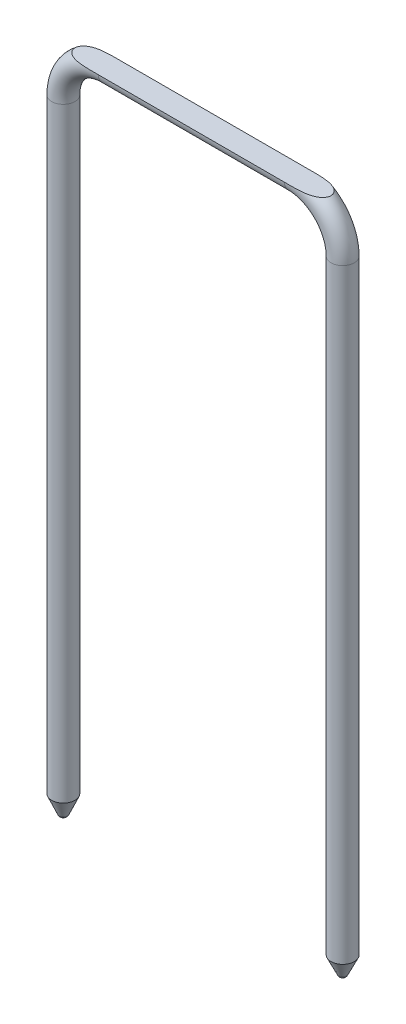
ISO-10303-21;
HEADER;
FILE_DESCRIPTION(('STEP AP214'),'2;1');
FILE_NAME('part.step','',(''),(''),'','','');
FILE_SCHEMA(('AUTOMOTIVE_DESIGN { 1 0 10303 214 1 1 1 1 }'));
ENDSEC;
DATA;
#1=APPLICATION_CONTEXT('core data for automotive mechanical design processes');
#2=APPLICATION_PROTOCOL_DEFINITION('international standard','automotive_design',2000,#1);
#3=PRODUCT_CONTEXT('',#1,'mechanical');
#4=PRODUCT('Part','Part','',(#3));
#5=PRODUCT_RELATED_PRODUCT_CATEGORY('part','',(#4));
#6=PRODUCT_DEFINITION_FORMATION('','',#4);
#7=PRODUCT_DEFINITION_CONTEXT('part definition',#1,'design');
#8=PRODUCT_DEFINITION('design','',#6,#7);
#9=PRODUCT_DEFINITION_SHAPE('','',#8);
#10=(LENGTH_UNIT() NAMED_UNIT(*) SI_UNIT(.MILLI.,.METRE.));
#11=(NAMED_UNIT(*) PLANE_ANGLE_UNIT() SI_UNIT($,.RADIAN.));
#12=(NAMED_UNIT(*) SI_UNIT($,.STERADIAN.) SOLID_ANGLE_UNIT());
#13=UNCERTAINTY_MEASURE_WITH_UNIT(LENGTH_MEASURE(1.E-05),#10,'distance_accuracy_value','');
#14=(GEOMETRIC_REPRESENTATION_CONTEXT(3) GLOBAL_UNCERTAINTY_ASSIGNED_CONTEXT((#13)) GLOBAL_UNIT_ASSIGNED_CONTEXT((#10,
#11,#12)) REPRESENTATION_CONTEXT('',''));
#15=CARTESIAN_POINT('',(0.,0.,0.));
#16=DIRECTION('',(0.,0.,1.));
#17=DIRECTION('',(1.,0.,0.));
#18=AXIS2_PLACEMENT_3D('',#15,#16,#17);
#19=CARTESIAN_POINT('',(50.,130.,0.));
#20=DIRECTION('',(0.,0.,-1.));
#21=DIRECTION('',(-1.,0.,0.));
#22=AXIS2_PLACEMENT_3D('',#19,#20,#21);
#23=TOROIDAL_SURFACE('',#22,9.99999999999998,2.5);
#24=CARTESIAN_POINT('',(60.,130.,0.));
#25=DIRECTION('',(0.,-1.,0.));
#26=DIRECTION('',(0.,0.,1.));
#27=AXIS2_PLACEMENT_3D('',#24,#25,#26);
#28=CIRCLE('',#27,2.5);
#29=CARTESIAN_POINT('',(60.,130.,2.5));
#30=VERTEX_POINT('',#29);
#31=EDGE_CURVE('E89',#30,#30,#28,.T.);
#32=ORIENTED_EDGE('',*,*,#31,.F.);
#33=EDGE_LOOP('',(#32));
#34=FACE_BOUND('',#33,.T.);
#35=CARTESIAN_POINT('',(50.,140.,0.));
#36=DIRECTION('',(1.,0.,0.));
#37=DIRECTION('',(0.,0.,1.));
#38=AXIS2_PLACEMENT_3D('',#35,#36,#37);
#39=CIRCLE('',#38,2.5);
#40=CARTESIAN_POINT('',(50.,140.,2.5));
#41=VERTEX_POINT('',#40);
#42=CARTESIAN_POINT('',(50.,140.,-2.5));
#43=VERTEX_POINT('',#42);
#44=EDGE_CURVE('E83',#41,#43,#39,.T.);
#45=ORIENTED_EDGE('',*,*,#44,.T.);
#46=CARTESIAN_POINT('',(57.5,140.,0.));
#47=CARTESIAN_POINT('',(57.4999853952668,140.,0.0991316136780097));
#48=CARTESIAN_POINT('',(57.4900660240153,140.,0.198419454960006));
#49=CARTESIAN_POINT('',(57.4512969231497,140.,0.393312871097621));
#50=CARTESIAN_POINT('',(57.4224020057191,140.,0.488909077991788));
#51=CARTESIAN_POINT('',(57.3485058720528,140.,0.672594140153357));
#52=CARTESIAN_POINT('',(57.3036462931456,140.,0.760740836193033));
#53=CARTESIAN_POINT('',(57.200815819489,140.,0.928904151505597));
#54=CARTESIAN_POINT('',(57.142840555888,140.,1.00891804883215));
#55=CARTESIAN_POINT('',(56.9880862702515,140.,1.19461571914126));
#56=CARTESIAN_POINT('',(56.8856173457104,140.,1.29553860751711));
#57=CARTESIAN_POINT('',(56.6661734051504,140.,1.48003248284283));
#58=CARTESIAN_POINT('',(56.5491701809111,140.,1.56356885851045));
#59=CARTESIAN_POINT('',(56.3280321612715,140.,1.70122471069441));
#60=CARTESIAN_POINT('',(56.2254712435093,140.,1.75792951552601));
#61=CARTESIAN_POINT('',(56.0157598175273,140.,1.86223008538179));
#62=CARTESIAN_POINT('',(55.9086058093265,140.,1.90981874719111));
#63=CARTESIAN_POINT('',(55.6909035214289,140.,1.99705742516265));
#64=CARTESIAN_POINT('',(55.5803488716588,140.,2.03669134586337));
#65=CARTESIAN_POINT('',(55.3570799376479,140.,2.10892030850186));
#66=CARTESIAN_POINT('',(55.2443672281763,140.,2.14152028494196));
#67=CARTESIAN_POINT('',(54.8993282017732,140.,2.23146090967274));
#68=CARTESIAN_POINT('',(54.6645174199831,140.,2.27927036435045));
#69=CARTESIAN_POINT('',(54.1918306493491,140.,2.35659967637171));
#70=CARTESIAN_POINT('',(53.9539510187098,140.,2.38609527156261));
#71=CARTESIAN_POINT('',(53.4758636094267,140.,2.43225802545843));
#72=CARTESIAN_POINT('',(53.2356501362112,140.,2.44886286524089));
#73=CARTESIAN_POINT('',(52.7549478751368,140.,2.47346059126281));
#74=CARTESIAN_POINT('',(52.514459266318,140.,2.48145746257494));
#75=CARTESIAN_POINT('',(52.0310941006776,140.,2.49245968519802));
#76=CARTESIAN_POINT('',(51.7882166342279,140.,2.49541672669688));
#77=CARTESIAN_POINT('',(51.3024328311938,140.,2.498944504777));
#78=CARTESIAN_POINT('',(51.0595264938498,140.,2.49951505149338));
#79=CARTESIAN_POINT('',(50.574354988398,140.,2.50004099745329));
#80=CARTESIAN_POINT('',(50.3320898200265,140.,2.49999801619718));
#81=CARTESIAN_POINT('',(49.8475662698254,140.,2.50000191865032));
#82=CARTESIAN_POINT('',(49.6053078879971,140.,2.50004879982595));
#83=CARTESIAN_POINT('',(49.2037676693959,140.,2.49983177952314));
#84=CARTESIAN_POINT('',(49.0444858275523,140.,2.49966882513934));
#85=CARTESIAN_POINT('',(48.7259232313356,140.,2.49879598776342));
#86=CARTESIAN_POINT('',(48.5666424769618,140.,2.49808610518457));
#87=CARTESIAN_POINT('',(48.2479126317765,140.,2.49555502653143));
#88=CARTESIAN_POINT('',(48.0884635490271,140.,2.49373260581561));
#89=CARTESIAN_POINT('',(47.7695917147429,140.,2.48822415252106));
#90=CARTESIAN_POINT('',(47.6101689636823,140.,2.48453808940716));
#91=CARTESIAN_POINT('',(47.2918320488864,140.,2.47439527781919));
#92=CARTESIAN_POINT('',(47.1329176639989,140.,2.46794595552734));
#93=CARTESIAN_POINT('',(46.8152943064085,140.,2.45119875549953));
#94=CARTESIAN_POINT('',(46.656585319234,140.,2.44090116558329));
#95=CARTESIAN_POINT('',(46.339767525041,140.,2.41522231939595));
#96=CARTESIAN_POINT('',(46.1816582116496,140.,2.39984753925364));
#97=CARTESIAN_POINT('',(45.8661569925469,140.,2.36257125345405));
#98=CARTESIAN_POINT('',(45.7087652374626,140.,2.3406684362112));
#99=CARTESIAN_POINT('',(45.3923999564315,140.,2.28819973133559));
#100=CARTESIAN_POINT('',(45.2334511750606,140.,2.25748081428366));
#101=CARTESIAN_POINT('',(44.9179852334303,140.,2.18554389487908));
#102=CARTESIAN_POINT('',(44.761466735726,140.,2.14433190132641));
#103=CARTESIAN_POINT('',(44.453106358361,140.,2.04928051297231));
#104=CARTESIAN_POINT('',(44.3012447837885,140.,1.99550623117653));
#105=CARTESIAN_POINT('',(44.0039747217832,140.,1.87259157812549));
#106=CARTESIAN_POINT('',(43.8585561599085,140.,1.8034762905617));
#107=CARTESIAN_POINT('',(43.6123329792131,140.,1.66610590927598));
#108=CARTESIAN_POINT('',(43.5093397623025,140.,1.601804877814));
#109=CARTESIAN_POINT('',(43.3114890211098,140.,1.46135928842553));
#110=CARTESIAN_POINT('',(43.216638647787,140.,1.38520448242412));
#111=CARTESIAN_POINT('',(43.037755879814,140.,1.21924343411642));
#112=CARTESIAN_POINT('',(42.9538407354277,140.,1.12930868853804));
#113=CARTESIAN_POINT('',(42.802892655059,140.,0.936200359646214));
#114=CARTESIAN_POINT('',(42.7358242936469,140.,0.833055257005447));
#115=CARTESIAN_POINT('',(42.6390947516194,140.,0.644277405374004));
#116=CARTESIAN_POINT('',(42.60422732704,140.,0.561316418325854));
#117=CARTESIAN_POINT('',(42.5487368680465,140.,0.390739792682125));
#118=CARTESIAN_POINT('',(42.5281033482841,140.,0.303127631703758));
#119=CARTESIAN_POINT('',(42.5025575318537,140.,0.125249504360612));
#120=CARTESIAN_POINT('',(42.4977082907155,140.,0.0349743441851971));
#121=CARTESIAN_POINT('',(42.5043089494583,140.,-0.144980959198562));
#122=CARTESIAN_POINT('',(42.5157604294694,140.,-0.234661043875897));
#123=CARTESIAN_POINT('',(42.5529340203364,140.,-0.405567438706597));
#124=CARTESIAN_POINT('',(42.5778008107236,140.,-0.486983702683926));
#125=CARTESIAN_POINT('',(42.639601998229,140.,-0.645040441519101));
#126=CARTESIAN_POINT('',(42.676538673349,140.,-0.721680011596931));
#127=CARTESIAN_POINT('',(42.7769548011148,140.,-0.897793512290729));
#128=CARTESIAN_POINT('',(42.8451708982053,140.,-0.994566297641932));
#129=CARTESIAN_POINT('',(42.9963426453234,140.,-1.17589688663098));
#130=CARTESIAN_POINT('',(43.0793373494113,140.,-1.26042122183628));
#131=CARTESIAN_POINT('',(43.2988386029472,140.,-1.45567440385525));
#132=CARTESIAN_POINT('',(43.4417436673303,140.,-1.55916357250013));
#133=CARTESIAN_POINT('',(43.7412306785716,140.,-1.74291899694027));
#134=CARTESIAN_POINT('',(43.8978134644803,140.,-1.82318382674971));
#135=CARTESIAN_POINT('',(44.2037097243142,140.,-1.95780483451447));
#136=CARTESIAN_POINT('',(44.3522714063194,140.,-2.01391153958338));
#137=CARTESIAN_POINT('',(44.6537170869599,140.,-2.1132270920933));
#138=CARTESIAN_POINT('',(44.8066050801376,140.,-2.15642356375426));
#139=CARTESIAN_POINT('',(45.1161129975945,140.,-2.23246109037745));
#140=CARTESIAN_POINT('',(45.2727524116637,140.,-2.26522127711426));
#141=CARTESIAN_POINT('',(45.5087893485944,140.,-2.30776616133447));
#142=CARTESIAN_POINT('',(45.5876177544981,140.,-2.320844831949));
#143=CARTESIAN_POINT('',(45.7455679625058,140.,-2.34503378090744));
#144=CARTESIAN_POINT('',(45.8246897310978,140.,-2.35614427741608));
#145=CARTESIAN_POINT('',(46.0882812518721,140.,-2.39019424271172));
#146=CARTESIAN_POINT('',(46.2732522454993,140.,-2.40927141038126));
#147=CARTESIAN_POINT('',(46.6438024819272,140.,-2.44031702949173));
#148=CARTESIAN_POINT('',(46.8293818865033,140.,-2.45228340444405));
#149=CARTESIAN_POINT('',(47.2010043049814,140.,-2.47110842216428));
#150=CARTESIAN_POINT('',(47.3870476073012,140.,-2.47796106639271));
#151=CARTESIAN_POINT('',(47.7592007472871,140.,-2.48822111480928));
#152=CARTESIAN_POINT('',(47.9453105767518,140.,-2.49162885301355));
#153=CARTESIAN_POINT('',(48.3186150457258,140.,-2.49638768324282));
#154=CARTESIAN_POINT('',(48.5058098124115,140.,-2.49772692243302));
#155=CARTESIAN_POINT('',(48.8802052714519,140.,-2.49937885314234));
#156=CARTESIAN_POINT('',(49.0674059638534,140.,-2.49969152782711));
#157=CARTESIAN_POINT('',(49.4416422199588,140.,-2.50000047719156));
#158=CARTESIAN_POINT('',(49.6286777836462,140.,-2.49999703075427));
#159=CARTESIAN_POINT('',(50.0027468590017,140.,-2.5000018160269));
#160=CARTESIAN_POINT('',(50.1897803706698,140.,-2.50001004760838));
#161=CARTESIAN_POINT('',(50.5626926901267,140.,-2.49996993008176));
#162=CARTESIAN_POINT('',(50.7485714978932,140.,-2.49992192997778));
#163=CARTESIAN_POINT('',(51.1203326009202,140.,-2.49931884396225));
#164=CARTESIAN_POINT('',(51.3062148961755,140.,-2.49876374781663));
#165=CARTESIAN_POINT('',(51.6782137181613,140.,-2.49633008257179));
#166=CARTESIAN_POINT('',(51.8643302365921,140.,-2.49444980104065));
#167=CARTESIAN_POINT('',(52.2365208110136,140.,-2.48820652353937));
#168=CARTESIAN_POINT('',(52.4225948683129,140.,-2.48384361877171));
#169=CARTESIAN_POINT('',(52.7931940597844,140.,-2.4712083233838));
#170=CARTESIAN_POINT('',(52.9777201418607,140.,-2.4629661318778));
#171=CARTESIAN_POINT('',(53.3464892540481,140.,-2.44083669365199));
#172=CARTESIAN_POINT('',(53.5307322258823,140.,-2.426948409355));
#173=CARTESIAN_POINT('',(53.89810571193,140.,-2.39149912102016));
#174=CARTESIAN_POINT('',(54.0812377602432,140.,-2.36995453367673));
#175=CARTESIAN_POINT('',(54.446006982489,140.,-2.3167808936465));
#176=CARTESIAN_POINT('',(54.6276449468977,140.,-2.28515757958118));
#177=CARTESIAN_POINT('',(54.8669637371543,140.,-2.23458556557385));
#178=CARTESIAN_POINT('',(54.9258790156858,140.,-2.2214100214677));
#179=CARTESIAN_POINT('',(55.0433600861271,140.,-2.19355006238627));
#180=CARTESIAN_POINT('',(55.1019258295994,140.,-2.17886544319964));
#181=CARTESIAN_POINT('',(55.2770843618071,140.,-2.13234696484349));
#182=CARTESIAN_POINT('',(55.3930439102455,140.,-2.09806803827261));
#183=CARTESIAN_POINT('',(55.6219394753131,140.,-2.02213825933732));
#184=CARTESIAN_POINT('',(55.7348872430512,140.,-1.9805232197533));
#185=CARTESIAN_POINT('',(55.9571789724787,140.,-1.88869629825143));
#186=CARTESIAN_POINT('',(56.0665252842531,140.,-1.83849016041148));
#187=CARTESIAN_POINT('',(56.3044863162866,140.,-1.71569050135757));
#188=CARTESIAN_POINT('',(56.4318416538545,140.,-1.64060210029336));
#189=CARTESIAN_POINT('',(56.6750182019926,140.,-1.47312063287959));
#190=CARTESIAN_POINT('',(56.7908363785574,140.,-1.38072303291832));
#191=CARTESIAN_POINT('',(56.9787101754385,140.,-1.20153196002487));
#192=CARTESIAN_POINT('',(57.0545807501232,140.,-1.11877048348975));
#193=CARTESIAN_POINT('',(57.1922187995191,140.,-0.942214201892169));
#194=CARTESIAN_POINT('',(57.2540087967285,140.,-0.848437385754091));
#195=CARTESIAN_POINT('',(57.3492987610765,140.,-0.669626614502734));
#196=CARTESIAN_POINT('',(57.3859344505475,140.,-0.586269249580728));
#197=CARTESIAN_POINT('',(57.4447653488034,140.,-0.414667223239366));
#198=CARTESIAN_POINT('',(57.4669928375605,140.,-0.326433970782103));
#199=CARTESIAN_POINT('',(57.4874493767817,140.,-0.197838392304161));
#200=CARTESIAN_POINT('',(57.4921453607824,140.,-0.158428504637776));
#201=CARTESIAN_POINT('',(57.4984239777793,140.,-0.0793541323454985));
#202=CARTESIAN_POINT('',(57.5000058473359,140.,-0.0396895876797151));
#203=CARTESIAN_POINT('',(57.5,140.,0.));
#204=B_SPLINE_CURVE_WITH_KNOTS('',3,(#46,#47,#48,#49,#50,#51,#52,#53,#54,#55,#56,#57,#58,#59,
#60,#61,#62,#63,#64,#65,#66,#67,#68,#69,#70,#71,#72,#73,#74,#75,#76,#77,#78,#79,#80,#81,#82,#83,
#84,#85,#86,#87,#88,#89,#90,#91,#92,#93,#94,#95,#96,#97,#98,#99,#100,#101,#102,#103,#104,#105,
#106,#107,#108,#109,#110,#111,#112,#113,#114,#115,#116,#117,#118,#119,#120,#121,#122,#123,#124,
#125,#126,#127,#128,#129,#130,#131,#132,#133,#134,#135,#136,#137,#138,#139,#140,#141,#142,#143,
#144,#145,#146,#147,#148,#149,#150,#151,#152,#153,#154,#155,#156,#157,#158,#159,#160,#161,#162,
#163,#164,#165,#166,#167,#168,#169,#170,#171,#172,#173,#174,#175,#176,#177,#178,#179,#180,#181,
#182,#183,#184,#185,#186,#187,#188,#189,#190,#191,#192,#193,#194,#195,#196,#197,#198,#199,#200,
#201,#202,#203),.UNSPECIFIED.,.T.,.F.,(4,2,2,2,2,2,2,2,2,2,2,2,2,2,2,2,2,2,2,2,2,2,2,2,2,2,2,2,
2,2,2,2,2,2,2,2,2,2,2,2,2,2,2,2,2,2,2,2,2,2,2,2,2,2,2,2,2,2,2,2,2,2,2,2,2,2,2,2,2,2,2,2,2,2,2,2,
2,2,4),(0.,0.297197230956412,0.595104777780832,0.89043262841876,1.1858589983708,
1.61492254520328,2.04483222626723,2.39591824435846,2.74727672251927,3.09933911988028,
3.45115372708017,4.1688666174717,4.88752831452882,5.60964303251144,6.33142330237017,
7.06008415081382,7.78880296899504,8.5155985795802,9.24237369881829,9.72021923629445,
10.1980644126945,10.6764365345178,11.1548164945622,11.6319188072756,12.1089854436813,
12.585445900767,13.0620021508756,13.5473904023087,14.0325013216492,14.5151515114761,
14.9970182706039,15.360591924214,15.7244816661355,16.0919984383059,16.4587358014733,
16.7276084991621,16.9962829207581,17.2660293425072,17.5358019142301,17.7901162615204,
18.044478634413,18.3976948076224,18.7518586326079,19.278214169698,19.8046020184221,
20.2803050089425,20.7564625575475,21.2362247204984,21.4759233996354,21.7155954924228,
22.2732384910676,22.8310442523,23.3895033101173,23.9479082148654,24.5095011529934,
25.07110330048,25.632210005559,26.1933105400361,26.7509469520138,27.3085946183058,
27.8669642128053,28.4253132961795,28.9793859231407,29.5335604175703,30.0865537468525,
30.6392327738299,30.8203278612143,31.0014474871339,31.3639759959585,31.7247814246035,
32.0853465517328,32.5277457792021,32.9702610419462,33.3059479174078,33.6410940179627,
33.9131593996742,34.1846131229411,34.3035736082177,34.4225632535848),.UNSPECIFIED.);
#205=EDGE_CURVE('E84',#43,#41,#204,.T.);
#206=ORIENTED_EDGE('',*,*,#205,.T.);
#207=EDGE_LOOP('',(#45,#206));
#208=FACE_BOUND('',#207,.T.);
#209=ADVANCED_FACE('F39',(#34,#208),#23,.T.);
#210=CARTESIAN_POINT('',(9.99999999999999,140.,0.));
#211=DIRECTION('',(1.,0.,0.));
#212=DIRECTION('',(0.,0.,-1.));
#213=AXIS2_PLACEMENT_3D('',#210,#211,#212);
#214=CYLINDRICAL_SURFACE('',#213,2.5);
#215=ORIENTED_EDGE('',*,*,#44,.F.);
#216=DIRECTION('',(1.,0.,0.));
#217=VECTOR('',#216,1.);
#218=CARTESIAN_POINT('',(9.99999999999999,140.,2.5));
#219=LINE('',#218,#217);
#220=CARTESIAN_POINT('',(9.99999999999999,140.,2.5));
#221=VERTEX_POINT('',#220);
#222=EDGE_CURVE('E73',#41,#221,#219,.F.);
#223=ORIENTED_EDGE('',*,*,#222,.T.);
#224=CARTESIAN_POINT('',(9.99999999999999,140.,0.));
#225=DIRECTION('',(1.,0.,0.));
#226=DIRECTION('',(0.,0.,1.));
#227=AXIS2_PLACEMENT_3D('',#224,#225,#226);
#228=CIRCLE('',#227,2.5);
#229=CARTESIAN_POINT('',(9.99999999999999,140.,-2.5));
#230=VERTEX_POINT('',#229);
#231=EDGE_CURVE('E81',#221,#230,#228,.T.);
#232=ORIENTED_EDGE('',*,*,#231,.T.);
#233=DIRECTION('',(1.,0.,0.));
#234=VECTOR('',#233,1.);
#235=CARTESIAN_POINT('',(9.99999999999999,140.,-2.5));
#236=LINE('',#235,#234);
#237=EDGE_CURVE('E58',#230,#43,#236,.T.);
#238=ORIENTED_EDGE('',*,*,#237,.T.);
#239=EDGE_LOOP('',(#215,#223,#232,#238));
#240=FACE_BOUND('',#239,.T.);
#241=ADVANCED_FACE('F80',(#240),#214,.T.);
#242=CARTESIAN_POINT('',(10.,130.,0.));
#243=DIRECTION('',(0.,0.,-1.));
#244=DIRECTION('',(-1.,0.,0.));
#245=AXIS2_PLACEMENT_3D('',#242,#243,#244);
#246=TOROIDAL_SURFACE('',#245,10.,2.5);
#247=CARTESIAN_POINT('',(0.,130.,0.));
#248=DIRECTION('',(0.,1.,0.));
#249=DIRECTION('',(0.,0.,1.));
#250=AXIS2_PLACEMENT_3D('',#247,#248,#249);
#251=CIRCLE('',#250,2.5);
#252=CARTESIAN_POINT('',(0.,130.,2.5));
#253=VERTEX_POINT('',#252);
#254=EDGE_CURVE('E87',#253,#253,#251,.T.);
#255=ORIENTED_EDGE('',*,*,#254,.T.);
#256=EDGE_LOOP('',(#255));
#257=FACE_BOUND('',#256,.T.);
#258=ORIENTED_EDGE('',*,*,#231,.F.);
#259=CARTESIAN_POINT('',(2.49999999999997,140.,0.));
#260=CARTESIAN_POINT('',(2.50001460473322,140.,-0.09913161367801));
#261=CARTESIAN_POINT('',(2.50993397598469,140.,-0.198419454960007));
#262=CARTESIAN_POINT('',(2.54870307685028,140.,-0.393312871097622));
#263=CARTESIAN_POINT('',(2.57759799428083,140.,-0.48890907799179));
#264=CARTESIAN_POINT('',(2.65149412794721,140.,-0.672594140153358));
#265=CARTESIAN_POINT('',(2.6963537068544,140.,-0.760740836193034));
#266=CARTESIAN_POINT('',(2.79918418051102,140.,-0.9289041515056));
#267=CARTESIAN_POINT('',(2.85715944411194,140.,-1.00891804883216));
#268=CARTESIAN_POINT('',(3.01191372974843,140.,-1.19461571914126));
#269=CARTESIAN_POINT('',(3.11438265428952,140.,-1.29553860751712));
#270=CARTESIAN_POINT('',(3.33382659484954,140.,-1.48003248284284));
#271=CARTESIAN_POINT('',(3.45082981908883,140.,-1.56356885851045));
#272=CARTESIAN_POINT('',(3.67196783872845,140.,-1.70122471069441));
#273=CARTESIAN_POINT('',(3.77452875649066,140.,-1.75792951552601));
#274=CARTESIAN_POINT('',(3.98424018247263,140.,-1.8622300853818));
#275=CARTESIAN_POINT('',(4.09139419067342,140.,-1.90981874719111));
#276=CARTESIAN_POINT('',(4.30909647857105,140.,-1.99705742516265));
#277=CARTESIAN_POINT('',(4.41965112834118,140.,-2.03669134586337));
#278=CARTESIAN_POINT('',(4.64292006235205,140.,-2.10892030850186));
#279=CARTESIAN_POINT('',(4.75563277182368,140.,-2.14152028494196));
#280=CARTESIAN_POINT('',(5.10067179822676,140.,-2.23146090967274));
#281=CARTESIAN_POINT('',(5.33548258001686,140.,-2.27927036435045));
#282=CARTESIAN_POINT('',(5.80816935065085,140.,-2.35659967637172));
#283=CARTESIAN_POINT('',(6.04604898129012,140.,-2.38609527156261));
#284=CARTESIAN_POINT('',(6.52413639057329,140.,-2.43225802545843));
#285=CARTESIAN_POINT('',(6.76434986378878,140.,-2.44886286524089));
#286=CARTESIAN_POINT('',(7.24505212486316,140.,-2.47346059126281));
#287=CARTESIAN_POINT('',(7.4855407336819,140.,-2.48145746257494));
#288=CARTESIAN_POINT('',(7.96890589932231,140.,-2.49245968519802));
#289=CARTESIAN_POINT('',(8.21178336577201,140.,-2.49541672669688));
#290=CARTESIAN_POINT('',(8.69756716880612,140.,-2.49894450477701));
#291=CARTESIAN_POINT('',(8.9404735061501,140.,-2.49951505149338));
#292=CARTESIAN_POINT('',(9.42564501160196,140.,-2.50004099745329));
#293=CARTESIAN_POINT('',(9.6679101799734,140.,-2.49999801619718));
#294=CARTESIAN_POINT('',(10.1524337301745,140.,-2.50000191865032));
#295=CARTESIAN_POINT('',(10.3946921120028,140.,-2.50004879982595));
#296=CARTESIAN_POINT('',(10.796232330604,140.,-2.49983177952314));
#297=CARTESIAN_POINT('',(10.9555141724477,140.,-2.49966882513934));
#298=CARTESIAN_POINT('',(11.2740767686644,140.,-2.49879598776342));
#299=CARTESIAN_POINT('',(11.4333575230382,140.,-2.49808610518457));
#300=CARTESIAN_POINT('',(11.7520873682235,140.,-2.49555502653144));
#301=CARTESIAN_POINT('',(11.9115364509729,140.,-2.49373260581562));
#302=CARTESIAN_POINT('',(12.2304082852572,140.,-2.48822415252106));
#303=CARTESIAN_POINT('',(12.3898310363177,140.,-2.48453808940716));
#304=CARTESIAN_POINT('',(12.7081679511137,140.,-2.47439527781918));
#305=CARTESIAN_POINT('',(12.8670823360012,140.,-2.46794595552733));
#306=CARTESIAN_POINT('',(13.1847056935916,140.,-2.45119875549952));
#307=CARTESIAN_POINT('',(13.3434146807661,140.,-2.44090116558328));
#308=CARTESIAN_POINT('',(13.6602324749591,140.,-2.41522231939594));
#309=CARTESIAN_POINT('',(13.8183417883506,140.,-2.39984753925362));
#310=CARTESIAN_POINT('',(14.1338430074532,140.,-2.36257125345403));
#311=CARTESIAN_POINT('',(14.2912347625377,140.,-2.34066843621118));
#312=CARTESIAN_POINT('',(14.6076000435687,140.,-2.28819973133556));
#313=CARTESIAN_POINT('',(14.7665488249396,140.,-2.25748081428362));
#314=CARTESIAN_POINT('',(15.0820147665699,140.,-2.18554389487902));
#315=CARTESIAN_POINT('',(15.2385332642743,140.,-2.14433190132634));
#316=CARTESIAN_POINT('',(15.5468936416393,140.,-2.04928051297222));
#317=CARTESIAN_POINT('',(15.6987552162118,140.,-1.99550623117643));
#318=CARTESIAN_POINT('',(15.9960252782171,140.,-1.87259157812536));
#319=CARTESIAN_POINT('',(16.1414438400918,140.,-1.80347629056155));
#320=CARTESIAN_POINT('',(16.3876670207872,140.,-1.66610590927581));
#321=CARTESIAN_POINT('',(16.4906602376978,140.,-1.60180487781383));
#322=CARTESIAN_POINT('',(16.6885109788904,140.,-1.46135928842537));
#323=CARTESIAN_POINT('',(16.7833613522132,140.,-1.38520448242397));
#324=CARTESIAN_POINT('',(16.9622441201861,140.,-1.21924343411628));
#325=CARTESIAN_POINT('',(17.0461592645725,140.,-1.12930868853791));
#326=CARTESIAN_POINT('',(17.1971073449411,140.,-0.936200359646119));
#327=CARTESIAN_POINT('',(17.2641757063531,140.,-0.833055257005371));
#328=CARTESIAN_POINT('',(17.3609052483807,140.,-0.644277405373947));
#329=CARTESIAN_POINT('',(17.39577267296,140.,-0.561316418325796));
#330=CARTESIAN_POINT('',(17.4512631319535,140.,-0.390739792682065));
#331=CARTESIAN_POINT('',(17.4718966517159,140.,-0.303127631703698));
#332=CARTESIAN_POINT('',(17.4974424681464,140.,-0.125249504360553));
#333=CARTESIAN_POINT('',(17.5022917092846,140.,-0.0349743441851395));
#334=CARTESIAN_POINT('',(17.4956910505417,140.,0.144980959198617));
#335=CARTESIAN_POINT('',(17.4842395705307,140.,0.234661043875951));
#336=CARTESIAN_POINT('',(17.4470659796636,140.,0.405567438706648));
#337=CARTESIAN_POINT('',(17.4221991892764,140.,0.486983702683976));
#338=CARTESIAN_POINT('',(17.360398001771,140.,0.645040441519149));
#339=CARTESIAN_POINT('',(17.323461326651,140.,0.721680011596979));
#340=CARTESIAN_POINT('',(17.2230451988852,140.,0.897793512290778));
#341=CARTESIAN_POINT('',(17.1548291017947,140.,0.994566297641981));
#342=CARTESIAN_POINT('',(17.0036573546766,140.,1.17589688663103));
#343=CARTESIAN_POINT('',(16.9206626505887,140.,1.26042122183633));
#344=CARTESIAN_POINT('',(16.7011613970528,140.,1.45567440385529));
#345=CARTESIAN_POINT('',(16.5582563326696,140.,1.55916357250018));
#346=CARTESIAN_POINT('',(16.2587693214284,140.,1.74291899694032));
#347=CARTESIAN_POINT('',(16.1021865355196,140.,1.82318382674976));
#348=CARTESIAN_POINT('',(15.7962902756857,140.,1.95780483451452));
#349=CARTESIAN_POINT('',(15.6477285936805,140.,2.01391153958343));
#350=CARTESIAN_POINT('',(15.34628291304,140.,2.11322709209334));
#351=CARTESIAN_POINT('',(15.1933949198623,140.,2.1564235637543));
#352=CARTESIAN_POINT('',(14.8838870024053,140.,2.23246109037749));
#353=CARTESIAN_POINT('',(14.7272475883361,140.,2.2652212771143));
#354=CARTESIAN_POINT('',(14.4912106514054,140.,2.30776616133451));
#355=CARTESIAN_POINT('',(14.4123822455017,140.,2.32084483194904));
#356=CARTESIAN_POINT('',(14.254432037494,140.,2.34503378090747));
#357=CARTESIAN_POINT('',(14.175310268902,140.,2.35614427741611));
#358=CARTESIAN_POINT('',(13.9117187481277,140.,2.39019424271175));
#359=CARTESIAN_POINT('',(13.7267477545005,140.,2.40927141038128));
#360=CARTESIAN_POINT('',(13.3561975180726,140.,2.44031702949175));
#361=CARTESIAN_POINT('',(13.1706181134964,140.,2.45228340444407));
#362=CARTESIAN_POINT('',(12.7989956950183,140.,2.47110842216429));
#363=CARTESIAN_POINT('',(12.6129523926984,140.,2.47796106639272));
#364=CARTESIAN_POINT('',(12.2407992527126,140.,2.48822111480928));
#365=CARTESIAN_POINT('',(12.0546894232478,140.,2.49162885301356));
#366=CARTESIAN_POINT('',(11.6813849542737,140.,2.49638768324283));
#367=CARTESIAN_POINT('',(11.4941901875881,140.,2.49772692243302));
#368=CARTESIAN_POINT('',(11.1197947285477,140.,2.49937885314234));
#369=CARTESIAN_POINT('',(10.9325940361461,140.,2.49969152782712));
#370=CARTESIAN_POINT('',(10.5583577800407,140.,2.50000047719156));
#371=CARTESIAN_POINT('',(10.3713222163533,140.,2.49999703075427));
#372=CARTESIAN_POINT('',(9.99725314099778,140.,2.5000018160269));
#373=CARTESIAN_POINT('',(9.81021962932966,140.,2.50001004760838));
#374=CARTESIAN_POINT('',(9.43730730987271,140.,2.49996993008176));
#375=CARTESIAN_POINT('',(9.25142850210625,140.,2.49992192997778));
#376=CARTESIAN_POINT('',(8.87966739907914,140.,2.49931884396225));
#377=CARTESIAN_POINT('',(8.69378510382381,140.,2.49876374781663));
#378=CARTESIAN_POINT('',(8.32178628183807,140.,2.49633008257178));
#379=CARTESIAN_POINT('',(8.1356697634072,140.,2.49444980104064));
#380=CARTESIAN_POINT('',(7.76347918898568,140.,2.48820652353936));
#381=CARTESIAN_POINT('',(7.57740513168637,140.,2.48384361877169));
#382=CARTESIAN_POINT('',(7.20680594021483,140.,2.47120832338377));
#383=CARTESIAN_POINT('',(7.02227985813855,140.,2.46296613187777));
#384=CARTESIAN_POINT('',(6.65351074595107,140.,2.44083669365194));
#385=CARTESIAN_POINT('',(6.46926777411687,140.,2.42694840935494));
#386=CARTESIAN_POINT('',(6.10189428806916,140.,2.39149912102008));
#387=CARTESIAN_POINT('',(5.91876223975598,140.,2.36995453367663));
#388=CARTESIAN_POINT('',(5.55399301751019,140.,2.31678089364637));
#389=CARTESIAN_POINT('',(5.37235505310146,140.,2.28515757958103));
#390=CARTESIAN_POINT('',(5.13303626284484,140.,2.23458556557367));
#391=CARTESIAN_POINT('',(5.07412098431339,140.,2.22141002146752));
#392=CARTESIAN_POINT('',(4.95663991387218,140.,2.1935500623861));
#393=CARTESIAN_POINT('',(4.89807417039986,140.,2.17886544319947));
#394=CARTESIAN_POINT('',(4.72291563819229,140.,2.13234696484332));
#395=CARTESIAN_POINT('',(4.60695608975392,140.,2.09806803827245));
#396=CARTESIAN_POINT('',(4.37806052468648,140.,2.02213825933717));
#397=CARTESIAN_POINT('',(4.2651127569484,140.,1.98052321975316));
#398=CARTESIAN_POINT('',(4.04282102752098,140.,1.88869629825132));
#399=CARTESIAN_POINT('',(3.93347471574667,140.,1.83849016041139));
#400=CARTESIAN_POINT('',(3.69551368371326,140.,1.71569050135749));
#401=CARTESIAN_POINT('',(3.56815834614528,140.,1.64060210029326));
#402=CARTESIAN_POINT('',(3.32498179800722,140.,1.47312063287945));
#403=CARTESIAN_POINT('',(3.20916362144241,140.,1.38072303291816));
#404=CARTESIAN_POINT('',(3.02128982456132,140.,1.20153196002468));
#405=CARTESIAN_POINT('',(2.94541924987666,140.,1.11877048348957));
#406=CARTESIAN_POINT('',(2.80778120048079,140.,0.942214201892003));
#407=CARTESIAN_POINT('',(2.7459912032714,140.,0.848437385753932));
#408=CARTESIAN_POINT('',(2.6507012389234,140.,0.669626614502582));
#409=CARTESIAN_POINT('',(2.61406554945237,140.,0.586269249580575));
#410=CARTESIAN_POINT('',(2.55523465119656,140.,0.414667223239213));
#411=CARTESIAN_POINT('',(2.53300716243938,140.,0.326433970781952));
#412=CARTESIAN_POINT('',(2.51255062321829,140.,0.197838392304035));
#413=CARTESIAN_POINT('',(2.50785463921758,140.,0.158428504637675));
#414=CARTESIAN_POINT('',(2.50157602222062,140.,0.0793541323454479));
#415=CARTESIAN_POINT('',(2.4999941526641,140.,0.0396895876796898));
#416=CARTESIAN_POINT('',(2.49999999999997,140.,0.));
#417=B_SPLINE_CURVE_WITH_KNOTS('',3,(#259,#260,#261,#262,#263,#264,#265,#266,#267,#268,#269,
#270,#271,#272,#273,#274,#275,#276,#277,#278,#279,#280,#281,#282,#283,#284,#285,#286,#287,#288,
#289,#290,#291,#292,#293,#294,#295,#296,#297,#298,#299,#300,#301,#302,#303,#304,#305,#306,#307,
#308,#309,#310,#311,#312,#313,#314,#315,#316,#317,#318,#319,#320,#321,#322,#323,#324,#325,#326,
#327,#328,#329,#330,#331,#332,#333,#334,#335,#336,#337,#338,#339,#340,#341,#342,#343,#344,#345,
#346,#347,#348,#349,#350,#351,#352,#353,#354,#355,#356,#357,#358,#359,#360,#361,#362,#363,#364,
#365,#366,#367,#368,#369,#370,#371,#372,#373,#374,#375,#376,#377,#378,#379,#380,#381,#382,#383,
#384,#385,#386,#387,#388,#389,#390,#391,#392,#393,#394,#395,#396,#397,#398,#399,#400,#401,#402,
#403,#404,#405,#406,#407,#408,#409,#410,#411,#412,#413,#414,#415,#416),.UNSPECIFIED.,.T.,.F.,(4,
2,2,2,2,2,2,2,2,2,2,2,2,2,2,2,2,2,2,2,2,2,2,2,2,2,2,2,2,2,2,2,2,2,2,2,2,2,2,2,2,2,2,2,2,2,2,2,2,
2,2,2,2,2,2,2,2,2,2,2,2,2,2,2,2,2,2,2,2,2,2,2,2,2,2,2,2,2,4),(0.,0.297197230956412,
0.595104777780834,0.890432628418764,1.18585899837081,1.61492254520328,2.04483222626723,
2.39591824435846,2.74727672251927,3.09933911988027,3.45115372708017,4.16886661747169,
4.88752831452882,5.60964303251143,6.33142330237015,7.06008415081379,7.788802968995,
8.51559857958014,9.24237369881823,9.72021923629444,10.1980644126945,10.6764365345178,
11.1548164945623,11.6319188072758,12.1089854436815,12.5854459007672,13.0620021508758,
13.547390402309,14.0325013216496,14.5151515114764,14.9970182706043,15.3605919242144,
15.7244816661358,16.0919984383062,16.4587358014735,16.7276084991623,16.9962829207582,
17.2660293425073,17.5358019142302,17.7901162615205,18.0444786344131,18.3976948076225,
18.751858632608,19.2782141696982,19.8046020184223,20.2803050089427,20.7564625575477,
21.2362247204986,21.4759233996357,21.7155954924231,22.2732384910679,22.8310442523004,
23.3895033101177,23.9479082148658,24.509501152994,25.0711033004806,25.6322100055596,
26.1933105400367,26.7509469520145,27.3085946183065,27.8669642128061,28.4253132961804,
28.9793859231416,29.5335604175712,30.0865537468534,30.6392327738309,30.8203278612152,
31.0014474871347,31.3639759959591,31.724781424604,32.0853465517331,32.5277457792025,
32.9702610419466,33.3059479174082,33.641094017963,33.9131593996745,34.1846131229414,
34.3035736082179,34.4225632535849),.UNSPECIFIED.);
#418=EDGE_CURVE('E11',#221,#230,#417,.T.);
#419=ORIENTED_EDGE('',*,*,#418,.T.);
#420=EDGE_LOOP('',(#258,#419));
#421=FACE_BOUND('',#420,.T.);
#422=ADVANCED_FACE('F86',(#257,#421),#246,.T.);
#423=CARTESIAN_POINT('',(60.,130.,0.));
#424=DIRECTION('',(0.,-1.,0.));
#425=DIRECTION('',(1.,0.,0.));
#426=AXIS2_PLACEMENT_3D('',#423,#424,#425);
#427=CYLINDRICAL_SURFACE('',#426,2.5);
#428=ORIENTED_EDGE('',*,*,#31,.T.);
#429=EDGE_LOOP('',(#428));
#430=FACE_BOUND('',#429,.T.);
#431=CARTESIAN_POINT('',(60.,0.,0.));
#432=DIRECTION('',(0.,-1.,0.));
#433=DIRECTION('',(0.,0.,1.));
#434=AXIS2_PLACEMENT_3D('',#431,#432,#433);
#435=CIRCLE('',#434,2.5);
#436=CARTESIAN_POINT('',(60.,0.,2.5));
#437=VERTEX_POINT('',#436);
#438=EDGE_CURVE('E51',#437,#437,#435,.T.);
#439=ORIENTED_EDGE('',*,*,#438,.F.);
#440=EDGE_LOOP('',(#439));
#441=FACE_BOUND('',#440,.T.);
#442=ADVANCED_FACE('F41',(#430,#441),#427,.T.);
#443=CARTESIAN_POINT('',(0.,130.,0.));
#444=DIRECTION('',(0.,-1.,0.));
#445=DIRECTION('',(0.,0.,-1.));
#446=AXIS2_PLACEMENT_3D('',#443,#444,#445);
#447=CYLINDRICAL_SURFACE('',#446,2.5);
#448=ORIENTED_EDGE('',*,*,#254,.F.);
#449=EDGE_LOOP('',(#448));
#450=FACE_BOUND('',#449,.T.);
#451=CARTESIAN_POINT('',(0.,0.,0.));
#452=DIRECTION('',(0.,1.,0.));
#453=DIRECTION('',(-1.,0.,0.));
#454=AXIS2_PLACEMENT_3D('',#451,#452,#453);
#455=CIRCLE('',#454,2.5);
#456=CARTESIAN_POINT('',(-2.5,0.,0.));
#457=VERTEX_POINT('',#456);
#458=EDGE_CURVE('E154',#457,#457,#455,.T.);
#459=ORIENTED_EDGE('',*,*,#458,.T.);
#460=EDGE_LOOP('',(#459));
#461=FACE_BOUND('',#460,.T.);
#462=ADVANCED_FACE('F103',(#450,#461),#447,.T.);
#463=CARTESIAN_POINT('',(0.,-4.2,0.));
#464=CARTESIAN_POINT('',(0.62924395266151,-4.32790656239022,0.));
#465=CARTESIAN_POINT('',(0.921927601632906,-3.64178097141358,0.));
#466=B_SPLINE_CURVE_WITH_KNOTS('',2,(#463,#464,#465),.UNSPECIFIED.,.F.,.F.,(3,3),(0.,1.),.UNSPECIFIED.);
#467=CARTESIAN_POINT('',(0.,0.,0.));
#468=DIRECTION('',(0.,1.,0.));
#469=AXIS1_PLACEMENT('',#467,#468);
#470=SURFACE_OF_REVOLUTION('',#466,#469);
#471=CARTESIAN_POINT('',(0.,-3.64178097141358,0.));
#472=DIRECTION('',(0.,1.,0.));
#473=DIRECTION('',(-1.,0.,0.));
#474=AXIS2_PLACEMENT_3D('',#471,#472,#473);
#475=CIRCLE('',#474,0.921927601632906);
#476=CARTESIAN_POINT('',(-0.921927601632905,-3.64178097141358,0.));
#477=VERTEX_POINT('',#476);
#478=EDGE_CURVE('E92',#477,#477,#475,.T.);
#479=ORIENTED_EDGE('',*,*,#478,.F.);
#480=EDGE_LOOP('',(#479));
#481=FACE_BOUND('',#480,.T.);
#482=CARTESIAN_POINT('',(0.,-4.2,0.));
#483=VERTEX_POINT('',#482);
#484=VERTEX_LOOP('',#483);
#485=FACE_BOUND('',#484,.T.);
#486=ADVANCED_FACE('F109',(#481,#485),#470,.T.);
#487=CARTESIAN_POINT('',(0.,-3.64178097141358,0.));
#488=DIRECTION('',(0.,1.,0.));
#489=DIRECTION('',(-1.,0.,0.));
#490=AXIS2_PLACEMENT_3D('',#487,#488,#489);
#491=CONICAL_SURFACE('',#490,0.921927601632906,0.408900271813841);
#492=ORIENTED_EDGE('',*,*,#458,.F.);
#493=EDGE_LOOP('',(#492));
#494=FACE_BOUND('',#493,.T.);
#495=ORIENTED_EDGE('',*,*,#478,.T.);
#496=EDGE_LOOP('',(#495));
#497=FACE_BOUND('',#496,.T.);
#498=ADVANCED_FACE('F142',(#494,#497),#491,.T.);
#499=CARTESIAN_POINT('',(60.,0.,0.));
#500=DIRECTION('',(0.,1.,0.));
#501=DIRECTION('',(0.,0.,1.));
#502=AXIS2_PLACEMENT_3D('',#499,#500,#501);
#503=CONICAL_SURFACE('',#502,2.5,0.441253282347833);
#504=CARTESIAN_POINT('',(60.,-3.43795835796575,0.));
#505=DIRECTION('',(0.,1.,0.));
#506=DIRECTION('',(0.,0.,1.));
#507=AXIS2_PLACEMENT_3D('',#504,#505,#506);
#508=CIRCLE('',#507,0.876209345735124);
#509=CARTESIAN_POINT('',(60.,-3.43795835796575,0.876209345735124));
#510=VERTEX_POINT('',#509);
#511=EDGE_CURVE('E126',#510,#510,#508,.T.);
#512=ORIENTED_EDGE('',*,*,#511,.T.);
#513=EDGE_LOOP('',(#512));
#514=FACE_BOUND('',#513,.T.);
#515=ORIENTED_EDGE('',*,*,#438,.T.);
#516=EDGE_LOOP('',(#515));
#517=FACE_BOUND('',#516,.T.);
#518=ADVANCED_FACE('F100',(#514,#517),#503,.T.);
#519=CARTESIAN_POINT('',(59.1237906542649,-3.43795835796575,0.));
#520=CARTESIAN_POINT('',(59.3756821425128,-4.1373872245519,0.));
#521=CARTESIAN_POINT('',(60.,-4.,0.));
#522=B_SPLINE_CURVE_WITH_KNOTS('',2,(#519,#520,#521),.UNSPECIFIED.,.F.,.F.,(3,3),(0.,1.),.UNSPECIFIED.);
#523=CARTESIAN_POINT('',(60.,0.,0.));
#524=DIRECTION('',(0.,1.,0.));
#525=AXIS1_PLACEMENT('',#523,#524);
#526=SURFACE_OF_REVOLUTION('',#522,#525);
#527=CARTESIAN_POINT('',(60.,-4.,0.));
#528=VERTEX_POINT('',#527);
#529=VERTEX_LOOP('',#528);
#530=FACE_BOUND('',#529,.T.);
#531=ORIENTED_EDGE('',*,*,#511,.F.);
#532=EDGE_LOOP('',(#531));
#533=FACE_BOUND('',#532,.T.);
#534=ADVANCED_FACE('F135',(#530,#533),#526,.F.);
#535=CARTESIAN_POINT('',(72.,140.,3.40240357919527));
#536=DIRECTION('',(0.,1.,0.));
#537=DIRECTION('',(0.,0.,1.));
#538=AXIS2_PLACEMENT_3D('',#535,#536,#537);
#539=PLANE('',#538);
#540=ORIENTED_EDGE('',*,*,#237,.F.);
#541=ORIENTED_EDGE('',*,*,#418,.F.);
#542=ORIENTED_EDGE('',*,*,#222,.F.);
#543=ORIENTED_EDGE('',*,*,#205,.F.);
#544=EDGE_LOOP('',(#540,#541,#542,#543));
#545=FACE_BOUND('',#544,.T.);
#546=ADVANCED_FACE('F72',(#545),#539,.T.);
#547=CLOSED_SHELL('',(#209,#241,#422,#442,#462,#486,#498,#518,#534,#546));
#548=MANIFOLD_SOLID_BREP('B2',#547);
#549=ADVANCED_BREP_SHAPE_REPRESENTATION('',(#18,#548),#14);
#550=SHAPE_DEFINITION_REPRESENTATION(#9,#549);
ENDSEC;
END-ISO-10303-21;
